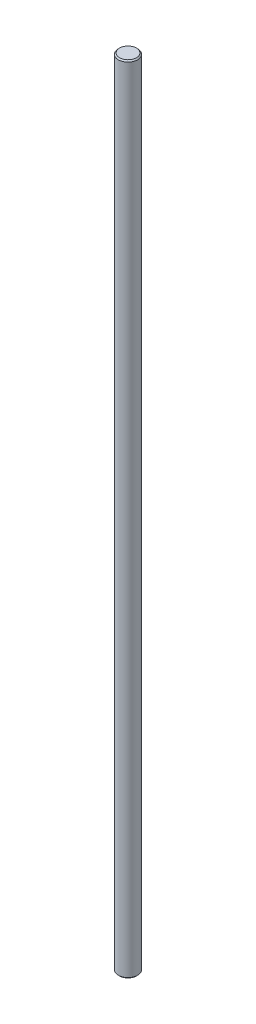
ISO-10303-21;
HEADER;
FILE_DESCRIPTION(('STEP AP214'),'2;1');
FILE_NAME('part.step','',(''),(''),'','','');
FILE_SCHEMA(('AUTOMOTIVE_DESIGN { 1 0 10303 214 1 1 1 1 }'));
ENDSEC;
DATA;
#1=APPLICATION_CONTEXT('core data for automotive mechanical design processes');
#2=APPLICATION_PROTOCOL_DEFINITION('international standard','automotive_design',2000,#1);
#3=PRODUCT_CONTEXT('',#1,'mechanical');
#4=PRODUCT('Part','Part','',(#3));
#5=PRODUCT_RELATED_PRODUCT_CATEGORY('part','',(#4));
#6=PRODUCT_DEFINITION_FORMATION('','',#4);
#7=PRODUCT_DEFINITION_CONTEXT('part definition',#1,'design');
#8=PRODUCT_DEFINITION('design','',#6,#7);
#9=PRODUCT_DEFINITION_SHAPE('','',#8);
#10=(LENGTH_UNIT() NAMED_UNIT(*) SI_UNIT(.MILLI.,.METRE.));
#11=(NAMED_UNIT(*) PLANE_ANGLE_UNIT() SI_UNIT($,.RADIAN.));
#12=(NAMED_UNIT(*) SI_UNIT($,.STERADIAN.) SOLID_ANGLE_UNIT());
#13=UNCERTAINTY_MEASURE_WITH_UNIT(LENGTH_MEASURE(1.E-05),#10,'distance_accuracy_value','');
#14=(GEOMETRIC_REPRESENTATION_CONTEXT(3) GLOBAL_UNCERTAINTY_ASSIGNED_CONTEXT((#13)) GLOBAL_UNIT_ASSIGNED_CONTEXT((#10,
#11,#12)) REPRESENTATION_CONTEXT('',''));
#15=CARTESIAN_POINT('',(0.,0.,0.));
#16=DIRECTION('',(0.,0.,1.));
#17=DIRECTION('',(1.,0.,0.));
#18=AXIS2_PLACEMENT_3D('',#15,#16,#17);
#19=CARTESIAN_POINT('',(0.,330.2,0.));
#20=DIRECTION('',(0.,-1.,0.));
#21=DIRECTION('',(0.,0.,-1.));
#22=AXIS2_PLACEMENT_3D('',#19,#20,#21);
#23=CYLINDRICAL_SURFACE('',#22,4.);
#24=CARTESIAN_POINT('',(0.,0.499999999999945,0.));
#25=DIRECTION('',(0.,1.,0.));
#26=DIRECTION('',(0.,0.,1.));
#27=AXIS2_PLACEMENT_3D('',#24,#25,#26);
#28=CIRCLE('',#27,4.);
#29=CARTESIAN_POINT('',(0.,0.499999999999945,4.));
#30=VERTEX_POINT('',#29);
#31=EDGE_CURVE('E42',#30,#30,#28,.T.);
#32=ORIENTED_EDGE('',*,*,#31,.T.);
#33=EDGE_LOOP('',(#32));
#34=FACE_BOUND('',#33,.T.);
#35=CARTESIAN_POINT('',(0.,329.7,0.));
#36=DIRECTION('',(0.,1.,0.));
#37=DIRECTION('',(0.,0.,1.));
#38=AXIS2_PLACEMENT_3D('',#35,#36,#37);
#39=CIRCLE('',#38,4.);
#40=CARTESIAN_POINT('',(0.,329.7,4.));
#41=VERTEX_POINT('',#40);
#42=EDGE_CURVE('E46',#41,#41,#39,.F.);
#43=ORIENTED_EDGE('',*,*,#42,.T.);
#44=EDGE_LOOP('',(#43));
#45=FACE_BOUND('',#44,.T.);
#46=ADVANCED_FACE('F31',(#34,#45),#23,.T.);
#47=CARTESIAN_POINT('',(0.,330.2,0.));
#48=DIRECTION('',(0.,1.,0.));
#49=DIRECTION('',(0.,0.,1.));
#50=AXIS2_PLACEMENT_3D('',#47,#48,#49);
#51=PLANE('',#50);
#52=CARTESIAN_POINT('',(0.,330.2,0.));
#53=DIRECTION('',(0.,1.,0.));
#54=DIRECTION('',(0.,0.,1.));
#55=AXIS2_PLACEMENT_3D('',#52,#53,#54);
#56=CIRCLE('',#55,3.5);
#57=CARTESIAN_POINT('',(0.,330.2,3.5));
#58=VERTEX_POINT('',#57);
#59=EDGE_CURVE('E10',#58,#58,#56,.T.);
#60=ORIENTED_EDGE('',*,*,#59,.T.);
#61=EDGE_LOOP('',(#60));
#62=FACE_BOUND('',#61,.T.);
#63=ADVANCED_FACE('F62',(#62),#51,.T.);
#64=CARTESIAN_POINT('',(0.,0.,0.));
#65=DIRECTION('',(0.,1.,0.));
#66=DIRECTION('',(0.,0.,1.));
#67=AXIS2_PLACEMENT_3D('',#64,#65,#66);
#68=PLANE('',#67);
#69=CARTESIAN_POINT('',(0.,0.,0.));
#70=DIRECTION('',(0.,1.,0.));
#71=DIRECTION('',(0.,0.,1.));
#72=AXIS2_PLACEMENT_3D('',#69,#70,#71);
#73=CIRCLE('',#72,3.50000000000006);
#74=CARTESIAN_POINT('',(0.,0.,3.50000000000006));
#75=VERTEX_POINT('',#74);
#76=EDGE_CURVE('E38',#75,#75,#73,.F.);
#77=ORIENTED_EDGE('',*,*,#76,.T.);
#78=EDGE_LOOP('',(#77));
#79=FACE_BOUND('',#78,.T.);
#80=ADVANCED_FACE('F59',(#79),#68,.F.);
#81=CARTESIAN_POINT('',(0.,0.499999999999945,0.));
#82=DIRECTION('',(0.,1.,0.));
#83=DIRECTION('',(0.,0.,1.));
#84=AXIS2_PLACEMENT_3D('',#81,#82,#83);
#85=CONICAL_SURFACE('',#84,4.,0.785398163397445);
#86=ORIENTED_EDGE('',*,*,#76,.F.);
#87=EDGE_LOOP('',(#86));
#88=FACE_BOUND('',#87,.T.);
#89=ORIENTED_EDGE('',*,*,#31,.F.);
#90=EDGE_LOOP('',(#89));
#91=FACE_BOUND('',#90,.T.);
#92=ADVANCED_FACE('F55',(#88,#91),#85,.T.);
#93=CARTESIAN_POINT('',(0.,330.2,0.));
#94=DIRECTION('',(0.,-1.,0.));
#95=DIRECTION('',(0.,0.,-1.));
#96=AXIS2_PLACEMENT_3D('',#93,#94,#95);
#97=CONICAL_SURFACE('',#96,3.5,0.785398163397389);
#98=ORIENTED_EDGE('',*,*,#42,.F.);
#99=EDGE_LOOP('',(#98));
#100=FACE_BOUND('',#99,.T.);
#101=ORIENTED_EDGE('',*,*,#59,.F.);
#102=EDGE_LOOP('',(#101));
#103=FACE_BOUND('',#102,.T.);
#104=ADVANCED_FACE('F33',(#100,#103),#97,.T.);
#105=CLOSED_SHELL('',(#46,#63,#80,#92,#104));
#106=MANIFOLD_SOLID_BREP('B2',#105);
#107=ADVANCED_BREP_SHAPE_REPRESENTATION('',(#18,#106),#14);
#108=SHAPE_DEFINITION_REPRESENTATION(#9,#107);
ENDSEC;
END-ISO-10303-21;
